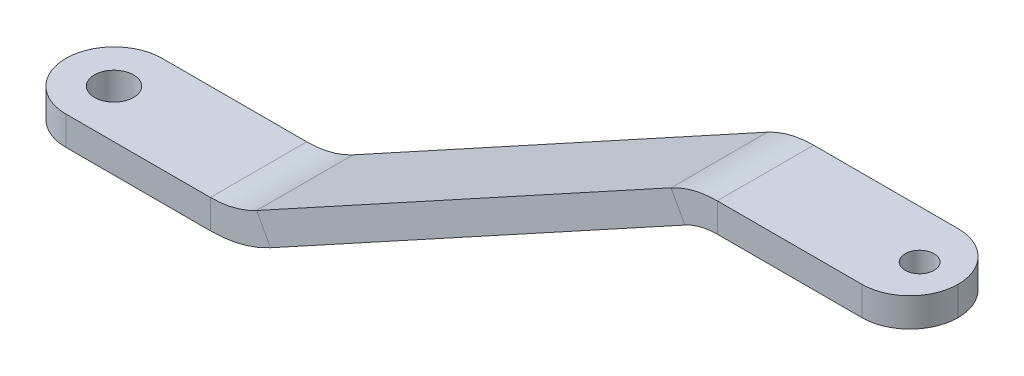
ISO-10303-21;
HEADER;
FILE_DESCRIPTION(('STEP AP214'),'2;1');
FILE_NAME('part.step','',(''),(''),'','','');
FILE_SCHEMA(('AUTOMOTIVE_DESIGN { 1 0 10303 214 1 1 1 1 }'));
ENDSEC;
DATA;
#1=APPLICATION_CONTEXT('core data for automotive mechanical design processes');
#2=APPLICATION_PROTOCOL_DEFINITION('international standard','automotive_design',2000,#1);
#3=PRODUCT_CONTEXT('',#1,'mechanical');
#4=PRODUCT('Part','Part','',(#3));
#5=PRODUCT_RELATED_PRODUCT_CATEGORY('part','',(#4));
#6=PRODUCT_DEFINITION_FORMATION('','',#4);
#7=PRODUCT_DEFINITION_CONTEXT('part definition',#1,'design');
#8=PRODUCT_DEFINITION('design','',#6,#7);
#9=PRODUCT_DEFINITION_SHAPE('','',#8);
#10=(LENGTH_UNIT() NAMED_UNIT(*) SI_UNIT(.MILLI.,.METRE.));
#11=(NAMED_UNIT(*) PLANE_ANGLE_UNIT() SI_UNIT($,.RADIAN.));
#12=(NAMED_UNIT(*) SI_UNIT($,.STERADIAN.) SOLID_ANGLE_UNIT());
#13=UNCERTAINTY_MEASURE_WITH_UNIT(LENGTH_MEASURE(1.E-05),#10,'distance_accuracy_value','');
#14=(GEOMETRIC_REPRESENTATION_CONTEXT(3) GLOBAL_UNCERTAINTY_ASSIGNED_CONTEXT((#13)) GLOBAL_UNIT_ASSIGNED_CONTEXT((#10,
#11,#12)) REPRESENTATION_CONTEXT('',''));
#15=CARTESIAN_POINT('',(0.,0.,0.));
#16=DIRECTION('',(0.,0.,1.));
#17=DIRECTION('',(1.,0.,0.));
#18=AXIS2_PLACEMENT_3D('',#15,#16,#17);
#19=CARTESIAN_POINT('',(-45.1750972762646,1.5,0.));
#20=DIRECTION('',(0.,0.,1.));
#21=DIRECTION('',(0.,-1.,0.));
#22=AXIS2_PLACEMENT_3D('',#19,#20,#21);
#23=PLANE('',#22);
#24=DIRECTION('',(1.,0.,0.));
#25=VECTOR('',#24,1.);
#26=CARTESIAN_POINT('',(-45.1750972762646,-1.5,0.));
#27=LINE('',#26,#25);
#28=CARTESIAN_POINT('',(-40.1750972762646,-1.5,0.));
#29=VERTEX_POINT('',#28);
#30=CARTESIAN_POINT('',(-25.1750972762646,-1.5,0.));
#31=VERTEX_POINT('',#30);
#32=EDGE_CURVE('E172',#29,#31,#27,.T.);
#33=ORIENTED_EDGE('',*,*,#32,.F.);
#34=DIRECTION('',(0.,-1.,0.));
#35=VECTOR('',#34,1.);
#36=CARTESIAN_POINT('',(-40.1750972762646,1.5,0.));
#37=LINE('',#36,#35);
#38=CARTESIAN_POINT('',(-40.1750972762646,1.5,0.));
#39=VERTEX_POINT('',#38);
#40=EDGE_CURVE('E11',#29,#39,#37,.F.);
#41=ORIENTED_EDGE('',*,*,#40,.T.);
#42=DIRECTION('',(1.,0.,0.));
#43=VECTOR('',#42,1.);
#44=CARTESIAN_POINT('',(-45.1750972762646,1.5,0.));
#45=LINE('',#44,#43);
#46=CARTESIAN_POINT('',(-25.1750972762646,1.5,0.));
#47=VERTEX_POINT('',#46);
#48=EDGE_CURVE('E136',#39,#47,#45,.T.);
#49=ORIENTED_EDGE('',*,*,#48,.T.);
#50=DIRECTION('',(0.,-1.,0.));
#51=VECTOR('',#50,1.);
#52=CARTESIAN_POINT('',(-25.1750972762646,1.5,0.));
#53=LINE('',#52,#51);
#54=EDGE_CURVE('E139',#47,#31,#53,.T.);
#55=ORIENTED_EDGE('',*,*,#54,.T.);
#56=EDGE_LOOP('',(#33,#41,#49,#55));
#57=FACE_BOUND('',#56,.T.);
#58=ADVANCED_FACE('F37',(#57),#23,.F.);
#59=CARTESIAN_POINT('',(-45.1750972762646,-1.5,10.));
#60=DIRECTION('',(0.,1.,0.));
#61=DIRECTION('',(0.,0.,1.));
#62=AXIS2_PLACEMENT_3D('',#59,#60,#61);
#63=PLANE('',#62);
#64=CARTESIAN_POINT('',(-40.1750972762646,-1.50000000000002,5.));
#65=DIRECTION('',(0.,1.,0.));
#66=DIRECTION('',(0.,0.,1.));
#67=AXIS2_PLACEMENT_3D('',#64,#65,#66);
#68=CIRCLE('',#67,2.032);
#69=CARTESIAN_POINT('',(-40.1750972762646,-1.50000000000002,7.032));
#70=VERTEX_POINT('',#69);
#71=EDGE_CURVE('E288',#70,#70,#68,.T.);
#72=ORIENTED_EDGE('',*,*,#71,.T.);
#73=EDGE_LOOP('',(#72));
#74=FACE_BOUND('',#73,.T.);
#75=DIRECTION('',(1.,0.,0.));
#76=VECTOR('',#75,1.);
#77=CARTESIAN_POINT('',(-45.1750972762646,-1.5,10.));
#78=LINE('',#77,#76);
#79=CARTESIAN_POINT('',(-40.1750972762646,-1.5,10.));
#80=VERTEX_POINT('',#79);
#81=CARTESIAN_POINT('',(-25.1750972762646,-1.5,10.));
#82=VERTEX_POINT('',#81);
#83=EDGE_CURVE('E213',#80,#82,#78,.T.);
#84=ORIENTED_EDGE('',*,*,#83,.F.);
#85=CARTESIAN_POINT('',(-40.1750972762646,-1.5,5.));
#86=DIRECTION('',(0.,1.,0.));
#87=DIRECTION('',(0.,0.,1.));
#88=AXIS2_PLACEMENT_3D('',#85,#86,#87);
#89=CIRCLE('',#88,5.);
#90=CARTESIAN_POINT('',(-45.1750972762646,-1.5,5.));
#91=VERTEX_POINT('',#90);
#92=EDGE_CURVE('E46',#80,#91,#89,.F.);
#93=ORIENTED_EDGE('',*,*,#92,.T.);
#94=CARTESIAN_POINT('',(-40.1750972762646,-1.5,5.));
#95=DIRECTION('',(0.,1.,0.));
#96=DIRECTION('',(0.,0.,1.));
#97=AXIS2_PLACEMENT_3D('',#94,#95,#96);
#98=CIRCLE('',#97,5.);
#99=EDGE_CURVE('E54',#91,#29,#98,.F.);
#100=ORIENTED_EDGE('',*,*,#99,.T.);
#101=ORIENTED_EDGE('',*,*,#32,.T.);
#102=DIRECTION('',(0.,0.,1.));
#103=VECTOR('',#102,1.);
#104=CARTESIAN_POINT('',(-25.1750972762646,-1.5,10.));
#105=LINE('',#104,#103);
#106=EDGE_CURVE('E174',#31,#82,#105,.T.);
#107=ORIENTED_EDGE('',*,*,#106,.T.);
#108=EDGE_LOOP('',(#84,#93,#100,#101,#107));
#109=FACE_BOUND('',#108,.T.);
#110=ADVANCED_FACE('F303',(#74,#109),#63,.F.);
#111=CARTESIAN_POINT('',(-45.1750972762646,1.5,10.));
#112=DIRECTION('',(0.,0.,-1.));
#113=DIRECTION('',(-1.,0.,0.));
#114=AXIS2_PLACEMENT_3D('',#111,#112,#113);
#115=PLANE('',#114);
#116=DIRECTION('',(1.,0.,0.));
#117=VECTOR('',#116,1.);
#118=CARTESIAN_POINT('',(-45.1750972762646,1.5,10.));
#119=LINE('',#118,#117);
#120=CARTESIAN_POINT('',(-40.1750972762646,1.5,10.));
#121=VERTEX_POINT('',#120);
#122=CARTESIAN_POINT('',(-25.1750972762646,1.5,10.));
#123=VERTEX_POINT('',#122);
#124=EDGE_CURVE('E164',#121,#123,#119,.T.);
#125=ORIENTED_EDGE('',*,*,#124,.F.);
#126=DIRECTION('',(0.,1.,0.));
#127=VECTOR('',#126,1.);
#128=CARTESIAN_POINT('',(-40.1750972762646,1.5,10.));
#129=LINE('',#128,#127);
#130=EDGE_CURVE('E277',#121,#80,#129,.F.);
#131=ORIENTED_EDGE('',*,*,#130,.T.);
#132=ORIENTED_EDGE('',*,*,#83,.T.);
#133=DIRECTION('',(0.,1.,0.));
#134=VECTOR('',#133,1.);
#135=CARTESIAN_POINT('',(-25.1750972762646,1.5,10.));
#136=LINE('',#135,#134);
#137=EDGE_CURVE('E215',#82,#123,#136,.T.);
#138=ORIENTED_EDGE('',*,*,#137,.T.);
#139=EDGE_LOOP('',(#125,#131,#132,#138));
#140=FACE_BOUND('',#139,.T.);
#141=ADVANCED_FACE('F298',(#140),#115,.F.);
#142=CARTESIAN_POINT('',(-45.1750972762646,1.5,10.));
#143=DIRECTION('',(0.,-1.,0.));
#144=DIRECTION('',(0.,0.,-1.));
#145=AXIS2_PLACEMENT_3D('',#142,#143,#144);
#146=PLANE('',#145);
#147=CARTESIAN_POINT('',(-40.1750972762646,1.5,5.));
#148=DIRECTION('',(0.,1.,0.));
#149=DIRECTION('',(0.,0.,1.));
#150=AXIS2_PLACEMENT_3D('',#147,#148,#149);
#151=CIRCLE('',#150,2.032);
#152=CARTESIAN_POINT('',(-40.1750972762646,1.5,7.032));
#153=VERTEX_POINT('',#152);
#154=EDGE_CURVE('E283',#153,#153,#151,.T.);
#155=ORIENTED_EDGE('',*,*,#154,.F.);
#156=EDGE_LOOP('',(#155));
#157=FACE_BOUND('',#156,.T.);
#158=CARTESIAN_POINT('',(-40.1750972762646,1.5,5.));
#159=DIRECTION('',(0.,-1.,0.));
#160=DIRECTION('',(0.,0.,-1.));
#161=AXIS2_PLACEMENT_3D('',#158,#159,#160);
#162=CIRCLE('',#161,5.);
#163=CARTESIAN_POINT('',(-45.1750972762646,1.5,5.));
#164=VERTEX_POINT('',#163);
#165=EDGE_CURVE('E273',#39,#164,#162,.F.);
#166=ORIENTED_EDGE('',*,*,#165,.T.);
#167=CARTESIAN_POINT('',(-40.1750972762646,1.5,5.));
#168=DIRECTION('',(0.,-1.,0.));
#169=DIRECTION('',(0.,0.,-1.));
#170=AXIS2_PLACEMENT_3D('',#167,#168,#169);
#171=CIRCLE('',#170,5.);
#172=EDGE_CURVE('E275',#164,#121,#171,.F.);
#173=ORIENTED_EDGE('',*,*,#172,.T.);
#174=ORIENTED_EDGE('',*,*,#124,.T.);
#175=DIRECTION('',(0.,0.,-1.));
#176=VECTOR('',#175,1.);
#177=CARTESIAN_POINT('',(-25.1750972762646,1.5,10.));
#178=LINE('',#177,#176);
#179=EDGE_CURVE('E153',#123,#47,#178,.T.);
#180=ORIENTED_EDGE('',*,*,#179,.T.);
#181=ORIENTED_EDGE('',*,*,#48,.F.);
#182=EDGE_LOOP('',(#166,#173,#174,#180,#181));
#183=FACE_BOUND('',#182,.T.);
#184=ADVANCED_FACE('F162',(#157,#183),#146,.F.);
#185=CARTESIAN_POINT('',(-25.1750972762646,1.49999999999998,0.));
#186=DIRECTION('',(0.,0.,1.));
#187=DIRECTION('',(1.,0.,0.));
#188=AXIS2_PLACEMENT_3D('',#185,#186,#187);
#189=PLANE('',#188);
#190=CARTESIAN_POINT('',(-25.1750972762646,11.5,0.));
#191=DIRECTION('',(0.,0.,1.));
#192=DIRECTION('',(0.,-1.,0.));
#193=AXIS2_PLACEMENT_3D('',#190,#191,#192);
#194=CIRCLE('',#193,13.);
#195=CARTESIAN_POINT('',(-18.9325625365749,0.0968969125168372,0.));
#196=VERTEX_POINT('',#195);
#197=EDGE_CURVE('E170',#31,#196,#194,.T.);
#198=ORIENTED_EDGE('',*,*,#197,.F.);
#199=ORIENTED_EDGE('',*,*,#54,.F.);
#200=CARTESIAN_POINT('',(-25.1750972762646,11.5,0.));
#201=DIRECTION('',(0.,0.,1.));
#202=DIRECTION('',(0.,-1.,0.));
#203=AXIS2_PLACEMENT_3D('',#200,#201,#202);
#204=CIRCLE('',#203,10.);
#205=CARTESIAN_POINT('',(-20.3731474765033,2.72838224039756,0.));
#206=VERTEX_POINT('',#205);
#207=EDGE_CURVE('E150',#47,#206,#204,.T.);
#208=ORIENTED_EDGE('',*,*,#207,.T.);
#209=DIRECTION('',(0.480194979976128,-0.877161775960242,0.));
#210=VECTOR('',#209,1.);
#211=CARTESIAN_POINT('',(-20.3731474765033,2.72838224039758,0.));
#212=LINE('',#211,#210);
#213=EDGE_CURVE('E160',#206,#196,#212,.T.);
#214=ORIENTED_EDGE('',*,*,#213,.T.);
#215=EDGE_LOOP('',(#198,#199,#208,#214));
#216=FACE_BOUND('',#215,.T.);
#217=ADVANCED_FACE('F168',(#216),#189,.F.);
#218=CARTESIAN_POINT('',(-25.1750972762646,11.5,0.));
#219=DIRECTION('',(0.,0.,1.));
#220=DIRECTION('',(1.,0.,0.));
#221=AXIS2_PLACEMENT_3D('',#218,#219,#220);
#222=CYLINDRICAL_SURFACE('',#221,13.);
#223=CARTESIAN_POINT('',(-25.1750972762646,11.5,10.));
#224=DIRECTION('',(0.,0.,1.));
#225=DIRECTION('',(0.,-1.,0.));
#226=AXIS2_PLACEMENT_3D('',#223,#224,#225);
#227=CIRCLE('',#226,13.);
#228=CARTESIAN_POINT('',(-18.9325625365749,0.0968969125168372,10.));
#229=VERTEX_POINT('',#228);
#230=EDGE_CURVE('E218',#82,#229,#227,.T.);
#231=ORIENTED_EDGE('',*,*,#230,.F.);
#232=ORIENTED_EDGE('',*,*,#106,.F.);
#233=ORIENTED_EDGE('',*,*,#197,.T.);
#234=DIRECTION('',(0.,0.,1.));
#235=VECTOR('',#234,1.);
#236=CARTESIAN_POINT('',(-18.9325625365749,0.0968969125168528,10.));
#237=LINE('',#236,#235);
#238=EDGE_CURVE('E180',#196,#229,#237,.T.);
#239=ORIENTED_EDGE('',*,*,#238,.T.);
#240=EDGE_LOOP('',(#231,#232,#233,#239));
#241=FACE_BOUND('',#240,.T.);
#242=ADVANCED_FACE('F305',(#241),#222,.T.);
#243=CARTESIAN_POINT('',(-25.1750972762646,1.49999999999999,10.));
#244=DIRECTION('',(0.,0.,-1.));
#245=DIRECTION('',(-1.,0.,0.));
#246=AXIS2_PLACEMENT_3D('',#243,#244,#245);
#247=PLANE('',#246);
#248=CARTESIAN_POINT('',(-25.1750972762646,11.5,10.));
#249=DIRECTION('',(0.,0.,1.));
#250=DIRECTION('',(0.,-1.,0.));
#251=AXIS2_PLACEMENT_3D('',#248,#249,#250);
#252=CIRCLE('',#251,10.);
#253=CARTESIAN_POINT('',(-20.3731474765033,2.72838224039757,10.));
#254=VERTEX_POINT('',#253);
#255=EDGE_CURVE('E241',#123,#254,#252,.T.);
#256=ORIENTED_EDGE('',*,*,#255,.F.);
#257=ORIENTED_EDGE('',*,*,#137,.F.);
#258=ORIENTED_EDGE('',*,*,#230,.T.);
#259=DIRECTION('',(-0.480194979976128,0.877161775960242,0.));
#260=VECTOR('',#259,1.);
#261=CARTESIAN_POINT('',(-20.3731474765033,2.72838224039758,10.));
#262=LINE('',#261,#260);
#263=EDGE_CURVE('E221',#229,#254,#262,.T.);
#264=ORIENTED_EDGE('',*,*,#263,.T.);
#265=EDGE_LOOP('',(#256,#257,#258,#264));
#266=FACE_BOUND('',#265,.T.);
#267=ADVANCED_FACE('F302',(#266),#247,.F.);
#268=CARTESIAN_POINT('',(-25.1750972762646,11.5,0.));
#269=DIRECTION('',(0.,0.,1.));
#270=DIRECTION('',(1.,0.,0.));
#271=AXIS2_PLACEMENT_3D('',#268,#269,#270);
#272=CYLINDRICAL_SURFACE('',#271,10.);
#273=DIRECTION('',(0.,0.,-1.));
#274=VECTOR('',#273,1.);
#275=CARTESIAN_POINT('',(-20.3731474765033,2.72838224039758,10.));
#276=LINE('',#275,#274);
#277=EDGE_CURVE('E156',#254,#206,#276,.T.);
#278=ORIENTED_EDGE('',*,*,#277,.T.);
#279=ORIENTED_EDGE('',*,*,#207,.F.);
#280=ORIENTED_EDGE('',*,*,#179,.F.);
#281=ORIENTED_EDGE('',*,*,#255,.T.);
#282=EDGE_LOOP('',(#278,#279,#280,#281));
#283=FACE_BOUND('',#282,.T.);
#284=ADVANCED_FACE('F151',(#283),#272,.F.);
#285=CARTESIAN_POINT('',(-20.3731474765033,2.72838224039758,0.));
#286=DIRECTION('',(0.,0.,1.));
#287=DIRECTION('',(0.,-1.,0.));
#288=AXIS2_PLACEMENT_3D('',#285,#286,#287);
#289=PLANE('',#288);
#290=DIRECTION('',(0.877161775960242,0.480194979976129,0.));
#291=VECTOR('',#290,1.);
#292=CARTESIAN_POINT('',(-18.9325625365749,0.0968969125168528,0.));
#293=LINE('',#292,#291);
#294=CARTESIAN_POINT('',(24.073356186071,23.6401324317217,0.));
#295=VERTEX_POINT('',#294);
#296=EDGE_CURVE('E185',#196,#295,#293,.T.);
#297=ORIENTED_EDGE('',*,*,#296,.F.);
#298=ORIENTED_EDGE('',*,*,#213,.F.);
#299=DIRECTION('',(0.877161775960242,0.480194979976129,0.));
#300=VECTOR('',#299,1.);
#301=CARTESIAN_POINT('',(-20.3731474765033,2.72838224039758,0.));
#302=LINE('',#301,#300);
#303=CARTESIAN_POINT('',(22.6327712461426,26.2716177596024,0.));
#304=VERTEX_POINT('',#303);
#305=EDGE_CURVE('E186',#206,#304,#302,.T.);
#306=ORIENTED_EDGE('',*,*,#305,.T.);
#307=DIRECTION('',(0.480194979976129,-0.877161775960242,0.));
#308=VECTOR('',#307,1.);
#309=CARTESIAN_POINT('',(22.6327712461426,26.2716177596024,0.));
#310=LINE('',#309,#308);
#311=EDGE_CURVE('E182',#304,#295,#310,.T.);
#312=ORIENTED_EDGE('',*,*,#311,.T.);
#313=EDGE_LOOP('',(#297,#298,#306,#312));
#314=FACE_BOUND('',#313,.T.);
#315=ADVANCED_FACE('F319',(#314),#289,.F.);
#316=CARTESIAN_POINT('',(-18.9325625365749,0.0968969125168528,10.));
#317=DIRECTION('',(-0.480194979976129,0.877161775960242,0.));
#318=DIRECTION('',(-0.877161775960242,-0.480194979976129,0.));
#319=AXIS2_PLACEMENT_3D('',#316,#317,#318);
#320=PLANE('',#319);
#321=DIRECTION('',(0.877161775960242,0.480194979976129,0.));
#322=VECTOR('',#321,1.);
#323=CARTESIAN_POINT('',(-18.9325625365749,0.0968969125168528,10.));
#324=LINE('',#323,#322);
#325=CARTESIAN_POINT('',(24.073356186071,23.6401324317217,10.));
#326=VERTEX_POINT('',#325);
#327=EDGE_CURVE('E224',#229,#326,#324,.T.);
#328=ORIENTED_EDGE('',*,*,#327,.F.);
#329=ORIENTED_EDGE('',*,*,#238,.F.);
#330=ORIENTED_EDGE('',*,*,#296,.T.);
#331=DIRECTION('',(0.,0.,1.));
#332=VECTOR('',#331,1.);
#333=CARTESIAN_POINT('',(24.073356186071,23.6401324317217,10.));
#334=LINE('',#333,#332);
#335=EDGE_CURVE('E189',#295,#326,#334,.T.);
#336=ORIENTED_EDGE('',*,*,#335,.T.);
#337=EDGE_LOOP('',(#328,#329,#330,#336));
#338=FACE_BOUND('',#337,.T.);
#339=ADVANCED_FACE('F308',(#338),#320,.F.);
#340=CARTESIAN_POINT('',(-20.3731474765033,2.72838224039758,10.));
#341=DIRECTION('',(0.,0.,-1.));
#342=DIRECTION('',(-1.,0.,0.));
#343=AXIS2_PLACEMENT_3D('',#340,#341,#342);
#344=PLANE('',#343);
#345=DIRECTION('',(0.877161775960242,0.480194979976129,0.));
#346=VECTOR('',#345,1.);
#347=CARTESIAN_POINT('',(-20.3731474765033,2.72838224039758,10.));
#348=LINE('',#347,#346);
#349=CARTESIAN_POINT('',(22.6327712461426,26.2716177596024,10.));
#350=VERTEX_POINT('',#349);
#351=EDGE_CURVE('E245',#254,#350,#348,.T.);
#352=ORIENTED_EDGE('',*,*,#351,.F.);
#353=ORIENTED_EDGE('',*,*,#263,.F.);
#354=ORIENTED_EDGE('',*,*,#327,.T.);
#355=DIRECTION('',(-0.480194979976129,0.877161775960242,0.));
#356=VECTOR('',#355,1.);
#357=CARTESIAN_POINT('',(22.6327712461426,26.2716177596024,10.));
#358=LINE('',#357,#356);
#359=EDGE_CURVE('E227',#326,#350,#358,.T.);
#360=ORIENTED_EDGE('',*,*,#359,.T.);
#361=EDGE_LOOP('',(#352,#353,#354,#360));
#362=FACE_BOUND('',#361,.T.);
#363=ADVANCED_FACE('F312',(#362),#344,.F.);
#364=CARTESIAN_POINT('',(-20.3731474765033,2.72838224039758,10.));
#365=DIRECTION('',(0.480194979976129,-0.877161775960242,0.));
#366=DIRECTION('',(0.877161775960242,0.480194979976129,0.));
#367=AXIS2_PLACEMENT_3D('',#364,#365,#366);
#368=PLANE('',#367);
#369=DIRECTION('',(0.,0.,-1.));
#370=VECTOR('',#369,1.);
#371=CARTESIAN_POINT('',(22.6327712461426,26.2716177596024,10.));
#372=LINE('',#371,#370);
#373=EDGE_CURVE('E202',#350,#304,#372,.T.);
#374=ORIENTED_EDGE('',*,*,#373,.T.);
#375=ORIENTED_EDGE('',*,*,#305,.F.);
#376=ORIENTED_EDGE('',*,*,#277,.F.);
#377=ORIENTED_EDGE('',*,*,#351,.T.);
#378=EDGE_LOOP('',(#374,#375,#376,#377));
#379=FACE_BOUND('',#378,.T.);
#380=ADVANCED_FACE('F315',(#379),#368,.F.);
#381=CARTESIAN_POINT('',(22.6327712461426,26.2716177596024,0.));
#382=DIRECTION('',(0.,0.,1.));
#383=DIRECTION('',(1.,0.,0.));
#384=AXIS2_PLACEMENT_3D('',#381,#382,#383);
#385=PLANE('',#384);
#386=CARTESIAN_POINT('',(27.4347210459039,17.5,0.));
#387=DIRECTION('',(0.,0.,-1.));
#388=DIRECTION('',(-0.48019497997613,0.877161775960241,0.));
#389=AXIS2_PLACEMENT_3D('',#386,#387,#388);
#390=CIRCLE('',#389,7.);
#391=CARTESIAN_POINT('',(27.4347210459039,24.5,0.));
#392=VERTEX_POINT('',#391);
#393=EDGE_CURVE('E195',#295,#392,#390,.T.);
#394=ORIENTED_EDGE('',*,*,#393,.F.);
#395=ORIENTED_EDGE('',*,*,#311,.F.);
#396=CARTESIAN_POINT('',(27.4347210459039,17.5,0.));
#397=DIRECTION('',(0.,0.,-1.));
#398=DIRECTION('',(-0.480194979976129,0.877161775960242,0.));
#399=AXIS2_PLACEMENT_3D('',#396,#397,#398);
#400=CIRCLE('',#399,9.99999999999999);
#401=CARTESIAN_POINT('',(27.4347210459039,27.5,0.));
#402=VERTEX_POINT('',#401);
#403=EDGE_CURVE('E196',#304,#402,#400,.T.);
#404=ORIENTED_EDGE('',*,*,#403,.T.);
#405=DIRECTION('',(0.,-1.,0.));
#406=VECTOR('',#405,1.);
#407=CARTESIAN_POINT('',(27.4347210459039,27.5,0.));
#408=LINE('',#407,#406);
#409=EDGE_CURVE('E192',#402,#392,#408,.T.);
#410=ORIENTED_EDGE('',*,*,#409,.T.);
#411=EDGE_LOOP('',(#394,#395,#404,#410));
#412=FACE_BOUND('',#411,.T.);
#413=ADVANCED_FACE('F321',(#412),#385,.F.);
#414=CARTESIAN_POINT('',(27.4347210459039,17.5,0.));
#415=DIRECTION('',(0.,0.,-1.));
#416=DIRECTION('',(-1.,0.,0.));
#417=AXIS2_PLACEMENT_3D('',#414,#415,#416);
#418=CYLINDRICAL_SURFACE('',#417,7.);
#419=CARTESIAN_POINT('',(27.4347210459039,17.5,10.));
#420=DIRECTION('',(0.,0.,-1.));
#421=DIRECTION('',(-0.48019497997613,0.877161775960241,0.));
#422=AXIS2_PLACEMENT_3D('',#419,#420,#421);
#423=CIRCLE('',#422,7.);
#424=CARTESIAN_POINT('',(27.4347210459039,24.5,10.));
#425=VERTEX_POINT('',#424);
#426=EDGE_CURVE('E230',#326,#425,#423,.T.);
#427=ORIENTED_EDGE('',*,*,#426,.F.);
#428=ORIENTED_EDGE('',*,*,#335,.F.);
#429=ORIENTED_EDGE('',*,*,#393,.T.);
#430=DIRECTION('',(0.,0.,1.));
#431=VECTOR('',#430,1.);
#432=CARTESIAN_POINT('',(27.4347210459039,24.5,10.));
#433=LINE('',#432,#431);
#434=EDGE_CURVE('E199',#392,#425,#433,.T.);
#435=ORIENTED_EDGE('',*,*,#434,.T.);
#436=EDGE_LOOP('',(#427,#428,#429,#435));
#437=FACE_BOUND('',#436,.T.);
#438=ADVANCED_FACE('F324',(#437),#418,.F.);
#439=CARTESIAN_POINT('',(22.6327712461426,26.2716177596024,10.));
#440=DIRECTION('',(0.,0.,-1.));
#441=DIRECTION('',(-1.,0.,0.));
#442=AXIS2_PLACEMENT_3D('',#439,#440,#441);
#443=PLANE('',#442);
#444=CARTESIAN_POINT('',(27.4347210459039,17.5,10.));
#445=DIRECTION('',(0.,0.,-1.));
#446=DIRECTION('',(-0.48019497997613,0.877161775960241,0.));
#447=AXIS2_PLACEMENT_3D('',#444,#445,#446);
#448=CIRCLE('',#447,10.);
#449=CARTESIAN_POINT('',(27.4347210459039,27.5,10.));
#450=VERTEX_POINT('',#449);
#451=EDGE_CURVE('E250',#350,#450,#448,.T.);
#452=ORIENTED_EDGE('',*,*,#451,.F.);
#453=ORIENTED_EDGE('',*,*,#359,.F.);
#454=ORIENTED_EDGE('',*,*,#426,.T.);
#455=DIRECTION('',(0.,1.,0.));
#456=VECTOR('',#455,1.);
#457=CARTESIAN_POINT('',(27.4347210459039,27.5,10.));
#458=LINE('',#457,#456);
#459=EDGE_CURVE('E233',#425,#450,#458,.T.);
#460=ORIENTED_EDGE('',*,*,#459,.T.);
#461=EDGE_LOOP('',(#452,#453,#454,#460));
#462=FACE_BOUND('',#461,.T.);
#463=ADVANCED_FACE('F327',(#462),#443,.F.);
#464=CARTESIAN_POINT('',(27.4347210459039,17.5,0.));
#465=DIRECTION('',(0.,0.,-1.));
#466=DIRECTION('',(-1.,0.,0.));
#467=AXIS2_PLACEMENT_3D('',#464,#465,#466);
#468=CYLINDRICAL_SURFACE('',#467,10.);
#469=DIRECTION('',(0.,0.,-1.));
#470=VECTOR('',#469,1.);
#471=CARTESIAN_POINT('',(27.4347210459039,27.5,10.));
#472=LINE('',#471,#470);
#473=EDGE_CURVE('E210',#450,#402,#472,.T.);
#474=ORIENTED_EDGE('',*,*,#473,.T.);
#475=ORIENTED_EDGE('',*,*,#403,.F.);
#476=ORIENTED_EDGE('',*,*,#373,.F.);
#477=ORIENTED_EDGE('',*,*,#451,.T.);
#478=EDGE_LOOP('',(#474,#475,#476,#477));
#479=FACE_BOUND('',#478,.T.);
#480=ADVANCED_FACE('F330',(#479),#468,.T.);
#481=CARTESIAN_POINT('',(27.4347210459039,27.5,0.));
#482=DIRECTION('',(0.,0.,1.));
#483=DIRECTION('',(0.,-1.,0.));
#484=AXIS2_PLACEMENT_3D('',#481,#482,#483);
#485=PLANE('',#484);
#486=DIRECTION('',(1.,0.,0.));
#487=VECTOR('',#486,1.);
#488=CARTESIAN_POINT('',(27.4347210459039,27.5,0.));
#489=LINE('',#488,#487);
#490=CARTESIAN_POINT('',(42.4347210459039,27.5,0.));
#491=VERTEX_POINT('',#490);
#492=EDGE_CURVE('E207',#402,#491,#489,.T.);
#493=ORIENTED_EDGE('',*,*,#492,.T.);
#494=DIRECTION('',(0.,-1.,0.));
#495=VECTOR('',#494,1.);
#496=CARTESIAN_POINT('',(42.4347210459039,24.5,0.));
#497=LINE('',#496,#495);
#498=CARTESIAN_POINT('',(42.4347210459039,24.5,0.));
#499=VERTEX_POINT('',#498);
#500=EDGE_CURVE('E254',#491,#499,#497,.T.);
#501=ORIENTED_EDGE('',*,*,#500,.T.);
#502=DIRECTION('',(1.,0.,0.));
#503=VECTOR('',#502,1.);
#504=CARTESIAN_POINT('',(27.4347210459039,24.5,0.));
#505=LINE('',#504,#503);
#506=EDGE_CURVE('E203',#392,#499,#505,.T.);
#507=ORIENTED_EDGE('',*,*,#506,.F.);
#508=ORIENTED_EDGE('',*,*,#409,.F.);
#509=EDGE_LOOP('',(#493,#501,#507,#508));
#510=FACE_BOUND('',#509,.T.);
#511=ADVANCED_FACE('F334',(#510),#485,.F.);
#512=CARTESIAN_POINT('',(27.4347210459039,24.5,10.));
#513=DIRECTION('',(0.,1.,0.));
#514=DIRECTION('',(0.,0.,1.));
#515=AXIS2_PLACEMENT_3D('',#512,#513,#514);
#516=PLANE('',#515);
#517=CARTESIAN_POINT('',(43.4347210459039,24.5,5.));
#518=DIRECTION('',(0.,1.,0.));
#519=DIRECTION('',(0.,0.,1.));
#520=AXIS2_PLACEMENT_3D('',#517,#518,#519);
#521=CIRCLE('',#520,1.5);
#522=CARTESIAN_POINT('',(41.9347210459039,24.5,5.));
#523=VERTEX_POINT('',#522);
#524=EDGE_CURVE('E144',#523,#523,#521,.T.);
#525=ORIENTED_EDGE('',*,*,#524,.T.);
#526=EDGE_LOOP('',(#525));
#527=FACE_BOUND('',#526,.T.);
#528=ORIENTED_EDGE('',*,*,#506,.T.);
#529=CARTESIAN_POINT('',(42.4347210459039,24.5,5.));
#530=DIRECTION('',(0.,1.,0.));
#531=DIRECTION('',(0.,0.,1.));
#532=AXIS2_PLACEMENT_3D('',#529,#530,#531);
#533=CIRCLE('',#532,5.);
#534=CARTESIAN_POINT('',(47.4347210459039,24.5,5.));
#535=VERTEX_POINT('',#534);
#536=EDGE_CURVE('E265',#499,#535,#533,.F.);
#537=ORIENTED_EDGE('',*,*,#536,.T.);
#538=CARTESIAN_POINT('',(42.4347210459039,24.5,5.));
#539=DIRECTION('',(0.,1.,0.));
#540=DIRECTION('',(0.,0.,1.));
#541=AXIS2_PLACEMENT_3D('',#538,#539,#540);
#542=CIRCLE('',#541,5.);
#543=CARTESIAN_POINT('',(42.4347210459039,24.5,10.));
#544=VERTEX_POINT('',#543);
#545=EDGE_CURVE('E263',#535,#544,#542,.F.);
#546=ORIENTED_EDGE('',*,*,#545,.T.);
#547=DIRECTION('',(1.,0.,0.));
#548=VECTOR('',#547,1.);
#549=CARTESIAN_POINT('',(27.4347210459039,24.5,10.));
#550=LINE('',#549,#548);
#551=EDGE_CURVE('E206',#425,#544,#550,.T.);
#552=ORIENTED_EDGE('',*,*,#551,.F.);
#553=ORIENTED_EDGE('',*,*,#434,.F.);
#554=EDGE_LOOP('',(#528,#537,#546,#552,#553));
#555=FACE_BOUND('',#554,.T.);
#556=ADVANCED_FACE('F337',(#527,#555),#516,.F.);
#557=CARTESIAN_POINT('',(27.4347210459039,27.5,10.));
#558=DIRECTION('',(0.,0.,-1.));
#559=DIRECTION('',(-1.,0.,0.));
#560=AXIS2_PLACEMENT_3D('',#557,#558,#559);
#561=PLANE('',#560);
#562=ORIENTED_EDGE('',*,*,#551,.T.);
#563=DIRECTION('',(0.,1.,0.));
#564=VECTOR('',#563,1.);
#565=CARTESIAN_POINT('',(42.4347210459039,27.5,10.));
#566=LINE('',#565,#564);
#567=CARTESIAN_POINT('',(42.4347210459039,27.5,10.));
#568=VERTEX_POINT('',#567);
#569=EDGE_CURVE('E271',#544,#568,#566,.T.);
#570=ORIENTED_EDGE('',*,*,#569,.T.);
#571=DIRECTION('',(1.,0.,0.));
#572=VECTOR('',#571,1.);
#573=CARTESIAN_POINT('',(27.4347210459039,27.5,10.));
#574=LINE('',#573,#572);
#575=EDGE_CURVE('E236',#450,#568,#574,.T.);
#576=ORIENTED_EDGE('',*,*,#575,.F.);
#577=ORIENTED_EDGE('',*,*,#459,.F.);
#578=EDGE_LOOP('',(#562,#570,#576,#577));
#579=FACE_BOUND('',#578,.T.);
#580=ADVANCED_FACE('F341',(#579),#561,.F.);
#581=CARTESIAN_POINT('',(27.4347210459039,27.5,10.));
#582=DIRECTION('',(0.,-1.,0.));
#583=DIRECTION('',(0.,0.,-1.));
#584=AXIS2_PLACEMENT_3D('',#581,#582,#583);
#585=PLANE('',#584);
#586=CARTESIAN_POINT('',(43.4347210459039,27.5,5.));
#587=DIRECTION('',(0.,1.,0.));
#588=DIRECTION('',(-1.,0.,0.));
#589=AXIS2_PLACEMENT_3D('',#586,#587,#588);
#590=CIRCLE('',#589,1.5);
#591=CARTESIAN_POINT('',(41.9347210459039,27.5,5.));
#592=VERTEX_POINT('',#591);
#593=EDGE_CURVE('E415',#592,#592,#590,.T.);
#594=ORIENTED_EDGE('',*,*,#593,.F.);
#595=EDGE_LOOP('',(#594));
#596=FACE_BOUND('',#595,.T.);
#597=CARTESIAN_POINT('',(42.4347210459039,27.5,5.));
#598=DIRECTION('',(0.,-1.,0.));
#599=DIRECTION('',(0.,0.,-1.));
#600=AXIS2_PLACEMENT_3D('',#597,#598,#599);
#601=CIRCLE('',#600,5.);
#602=CARTESIAN_POINT('',(47.4347210459039,27.5,5.));
#603=VERTEX_POINT('',#602);
#604=EDGE_CURVE('E267',#568,#603,#601,.F.);
#605=ORIENTED_EDGE('',*,*,#604,.T.);
#606=CARTESIAN_POINT('',(42.4347210459039,27.5,5.));
#607=DIRECTION('',(0.,-1.,0.));
#608=DIRECTION('',(0.,0.,-1.));
#609=AXIS2_PLACEMENT_3D('',#606,#607,#608);
#610=CIRCLE('',#609,5.);
#611=EDGE_CURVE('E269',#603,#491,#610,.F.);
#612=ORIENTED_EDGE('',*,*,#611,.T.);
#613=ORIENTED_EDGE('',*,*,#492,.F.);
#614=ORIENTED_EDGE('',*,*,#473,.F.);
#615=ORIENTED_EDGE('',*,*,#575,.T.);
#616=EDGE_LOOP('',(#605,#612,#613,#614,#615));
#617=FACE_BOUND('',#616,.T.);
#618=ADVANCED_FACE('F343',(#596,#617),#585,.F.);
#619=CARTESIAN_POINT('',(43.4347210459039,-1.50000000000006,5.));
#620=DIRECTION('',(0.,1.,0.));
#621=DIRECTION('',(-1.,0.,0.));
#622=AXIS2_PLACEMENT_3D('',#619,#620,#621);
#623=CYLINDRICAL_SURFACE('',#622,1.5);
#624=CARTESIAN_POINT('',(41.9347210459039,27.5,5.));
#625=CARTESIAN_POINT('',(41.9347210459039,27.46875,5.));
#626=CARTESIAN_POINT('',(41.9347210459039,27.4375,5.));
#627=CARTESIAN_POINT('',(41.9347210459039,27.375,5.));
#628=CARTESIAN_POINT('',(41.9347210459039,27.34375,5.));
#629=CARTESIAN_POINT('',(41.9347210459039,27.28125,5.));
#630=CARTESIAN_POINT('',(41.9347210459039,27.25,5.));
#631=CARTESIAN_POINT('',(41.9347210459039,27.1875,5.));
#632=CARTESIAN_POINT('',(41.9347210459039,27.15625,5.));
#633=CARTESIAN_POINT('',(41.9347210459039,27.09375,5.));
#634=CARTESIAN_POINT('',(41.9347210459039,27.0625,5.));
#635=CARTESIAN_POINT('',(41.9347210459039,27.,5.));
#636=CARTESIAN_POINT('',(41.9347210459039,26.96875,5.));
#637=CARTESIAN_POINT('',(41.9347210459039,26.90625,5.));
#638=CARTESIAN_POINT('',(41.9347210459039,26.875,5.));
#639=CARTESIAN_POINT('',(41.9347210459039,26.8125,5.));
#640=CARTESIAN_POINT('',(41.9347210459039,26.78125,5.));
#641=CARTESIAN_POINT('',(41.9347210459039,26.71875,5.));
#642=CARTESIAN_POINT('',(41.9347210459039,26.6875,5.));
#643=CARTESIAN_POINT('',(41.9347210459039,26.625,5.));
#644=CARTESIAN_POINT('',(41.9347210459039,26.59375,5.));
#645=CARTESIAN_POINT('',(41.9347210459039,26.53125,5.));
#646=CARTESIAN_POINT('',(41.9347210459039,26.5,5.));
#647=CARTESIAN_POINT('',(41.9347210459039,26.4375,5.));
#648=CARTESIAN_POINT('',(41.9347210459039,26.40625,5.));
#649=CARTESIAN_POINT('',(41.9347210459039,26.34375,5.));
#650=CARTESIAN_POINT('',(41.9347210459039,26.3125,5.));
#651=CARTESIAN_POINT('',(41.9347210459039,26.25,5.));
#652=CARTESIAN_POINT('',(41.9347210459039,26.21875,5.));
#653=CARTESIAN_POINT('',(41.9347210459039,26.15625,5.));
#654=CARTESIAN_POINT('',(41.9347210459039,26.125,5.));
#655=CARTESIAN_POINT('',(41.9347210459039,26.0625,5.));
#656=CARTESIAN_POINT('',(41.9347210459039,26.03125,5.));
#657=CARTESIAN_POINT('',(41.9347210459039,25.96875,5.));
#658=CARTESIAN_POINT('',(41.9347210459039,25.9375,5.));
#659=CARTESIAN_POINT('',(41.9347210459039,25.875,5.));
#660=CARTESIAN_POINT('',(41.9347210459039,25.84375,5.));
#661=CARTESIAN_POINT('',(41.9347210459039,25.78125,5.));
#662=CARTESIAN_POINT('',(41.9347210459039,25.75,5.));
#663=CARTESIAN_POINT('',(41.9347210459039,25.6875,5.));
#664=CARTESIAN_POINT('',(41.9347210459039,25.65625,5.));
#665=CARTESIAN_POINT('',(41.9347210459039,25.59375,5.));
#666=CARTESIAN_POINT('',(41.9347210459039,25.5625,5.));
#667=CARTESIAN_POINT('',(41.9347210459039,25.5,5.));
#668=CARTESIAN_POINT('',(41.9347210459039,25.46875,5.));
#669=CARTESIAN_POINT('',(41.9347210459039,25.40625,5.));
#670=CARTESIAN_POINT('',(41.9347210459039,25.375,5.));
#671=CARTESIAN_POINT('',(41.9347210459039,25.3125,5.));
#672=CARTESIAN_POINT('',(41.9347210459039,25.28125,5.));
#673=CARTESIAN_POINT('',(41.9347210459039,25.21875,5.));
#674=CARTESIAN_POINT('',(41.9347210459039,25.1875,5.));
#675=CARTESIAN_POINT('',(41.9347210459039,25.125,5.));
#676=CARTESIAN_POINT('',(41.9347210459039,25.09375,5.));
#677=CARTESIAN_POINT('',(41.9347210459039,25.03125,5.));
#678=CARTESIAN_POINT('',(41.9347210459039,25.,5.));
#679=CARTESIAN_POINT('',(41.9347210459039,24.9375,5.));
#680=CARTESIAN_POINT('',(41.9347210459039,24.90625,5.));
#681=CARTESIAN_POINT('',(41.9347210459039,24.84375,5.));
#682=CARTESIAN_POINT('',(41.9347210459039,24.8125,5.));
#683=CARTESIAN_POINT('',(41.9347210459039,24.75,5.));
#684=CARTESIAN_POINT('',(41.9347210459039,24.71875,5.));
#685=CARTESIAN_POINT('',(41.9347210459039,24.65625,5.));
#686=CARTESIAN_POINT('',(41.9347210459039,24.625,5.));
#687=CARTESIAN_POINT('',(41.9347210459039,24.5625,5.));
#688=CARTESIAN_POINT('',(41.9347210459039,24.53125,5.));
#689=CARTESIAN_POINT('',(41.9347210459039,24.5,5.));
#690=B_SPLINE_CURVE_WITH_KNOTS('',3,(#624,#625,#626,#627,#628,#629,#630,#631,#632,#633,#634,
#635,#636,#637,#638,#639,#640,#641,#642,#643,#644,#645,#646,#647,#648,#649,#650,#651,#652,#653,
#654,#655,#656,#657,#658,#659,#660,#661,#662,#663,#664,#665,#666,#667,#668,#669,#670,#671,#672,
#673,#674,#675,#676,#677,#678,#679,#680,#681,#682,#683,#684,#685,#686,#687,#688,#689),
.UNSPECIFIED.,.F.,.F.,(4,2,2,2,2,2,2,2,2,2,2,2,2,2,2,2,2,2,2,2,2,2,2,2,2,2,2,2,2,2,2,2,4),(0.,
0.0937500000000001,0.1875,0.281249999999997,0.374999999999997,0.468749999999997,
0.562499999999997,0.656249999999997,0.749999999999994,0.843749999999994,0.937499999999994,
1.03124999999999,1.12499999999999,1.21874999999999,1.31249999999999,1.40624999999999,
1.49999999999999,1.59374999999999,1.68749999999999,1.78124999999999,1.87499999999999,
1.96874999999999,2.06249999999999,2.15624999999999,2.24999999999999,2.34374999999998,
2.43749999999998,2.53124999999998,2.62499999999998,2.71874999999998,2.81249999999998,
2.90624999999998,2.99999999999998),.UNSPECIFIED.);
#691=EDGE_CURVE('BSEAM357',#592,#523,#690,.T.);
#692=ORIENTED_EDGE('',*,*,#593,.T.);
#693=ORIENTED_EDGE('',*,*,#524,.F.);
#694=ORIENTED_EDGE('',*,*,#691,.T.);
#695=ORIENTED_EDGE('',*,*,#691,.F.);
#696=EDGE_LOOP('',(#692,#694,#693,#695));
#697=FACE_BOUND('',#696,.T.);
#698=ADVANCED_FACE('F357',(#697),#623,.F.);
#699=CARTESIAN_POINT('',(-40.1750972762646,-1.50000000000002,5.));
#700=DIRECTION('',(0.,1.,0.));
#701=DIRECTION('',(0.,0.,1.));
#702=AXIS2_PLACEMENT_3D('',#699,#700,#701);
#703=CYLINDRICAL_SURFACE('',#702,2.032);
#704=ORIENTED_EDGE('',*,*,#71,.F.);
#705=EDGE_LOOP('',(#704));
#706=FACE_BOUND('',#705,.T.);
#707=ORIENTED_EDGE('',*,*,#154,.T.);
#708=EDGE_LOOP('',(#707));
#709=FACE_BOUND('',#708,.T.);
#710=ADVANCED_FACE('F353',(#706,#709),#703,.F.);
#711=CARTESIAN_POINT('',(42.4347210459039,27.5,5.));
#712=DIRECTION('',(0.,-1.,0.));
#713=DIRECTION('',(0.,0.,-1.));
#714=AXIS2_PLACEMENT_3D('',#711,#712,#713);
#715=CYLINDRICAL_SURFACE('',#714,5.);
#716=DIRECTION('',(0.,1.,0.));
#717=VECTOR('',#716,1.);
#718=CARTESIAN_POINT('',(47.4347210459039,24.5,5.));
#719=LINE('',#718,#717);
#720=EDGE_CURVE('E281',#603,#535,#719,.F.);
#721=ORIENTED_EDGE('',*,*,#720,.F.);
#722=ORIENTED_EDGE('',*,*,#604,.F.);
#723=ORIENTED_EDGE('',*,*,#569,.F.);
#724=ORIENTED_EDGE('',*,*,#545,.F.);
#725=EDGE_LOOP('',(#721,#722,#723,#724));
#726=FACE_BOUND('',#725,.T.);
#727=ADVANCED_FACE('F345',(#726),#715,.T.);
#728=CARTESIAN_POINT('',(42.4347210459039,27.5,5.));
#729=DIRECTION('',(0.,1.,0.));
#730=DIRECTION('',(0.,0.,1.));
#731=AXIS2_PLACEMENT_3D('',#728,#729,#730);
#732=CYLINDRICAL_SURFACE('',#731,5.);
#733=ORIENTED_EDGE('',*,*,#611,.F.);
#734=ORIENTED_EDGE('',*,*,#720,.T.);
#735=ORIENTED_EDGE('',*,*,#536,.F.);
#736=ORIENTED_EDGE('',*,*,#500,.F.);
#737=EDGE_LOOP('',(#733,#734,#735,#736));
#738=FACE_BOUND('',#737,.T.);
#739=ADVANCED_FACE('F346',(#738),#732,.T.);
#740=CARTESIAN_POINT('',(-40.1750972762646,0.,5.));
#741=DIRECTION('',(0.,-1.,0.));
#742=DIRECTION('',(0.,0.,-1.));
#743=AXIS2_PLACEMENT_3D('',#740,#741,#742);
#744=CYLINDRICAL_SURFACE('',#743,5.);
#745=ORIENTED_EDGE('',*,*,#40,.F.);
#746=ORIENTED_EDGE('',*,*,#99,.F.);
#747=DIRECTION('',(0.,-1.,0.));
#748=VECTOR('',#747,1.);
#749=CARTESIAN_POINT('',(-45.1750972762646,0.,5.));
#750=LINE('',#749,#748);
#751=EDGE_CURVE('E41',#164,#91,#750,.T.);
#752=ORIENTED_EDGE('',*,*,#751,.F.);
#753=ORIENTED_EDGE('',*,*,#165,.F.);
#754=EDGE_LOOP('',(#745,#746,#752,#753));
#755=FACE_BOUND('',#754,.T.);
#756=ADVANCED_FACE('F39',(#755),#744,.T.);
#757=CARTESIAN_POINT('',(-40.1750972762646,0.,5.));
#758=DIRECTION('',(0.,1.,0.));
#759=DIRECTION('',(0.,0.,1.));
#760=AXIS2_PLACEMENT_3D('',#757,#758,#759);
#761=CYLINDRICAL_SURFACE('',#760,5.);
#762=ORIENTED_EDGE('',*,*,#92,.F.);
#763=ORIENTED_EDGE('',*,*,#130,.F.);
#764=ORIENTED_EDGE('',*,*,#172,.F.);
#765=ORIENTED_EDGE('',*,*,#751,.T.);
#766=EDGE_LOOP('',(#762,#763,#764,#765));
#767=FACE_BOUND('',#766,.T.);
#768=ADVANCED_FACE('F294',(#767),#761,.T.);
#769=CLOSED_SHELL('',(#58,#110,#141,#184,#217,#242,#267,#284,#315,#339,#363,#380,#413,#438,#463,
#480,#511,#556,#580,#618,#698,#710,#727,#739,#756,#768));
#770=MANIFOLD_SOLID_BREP('B2',#769);
#771=ADVANCED_BREP_SHAPE_REPRESENTATION('',(#18,#770),#14);
#772=SHAPE_DEFINITION_REPRESENTATION(#9,#771);
ENDSEC;
END-ISO-10303-21;
